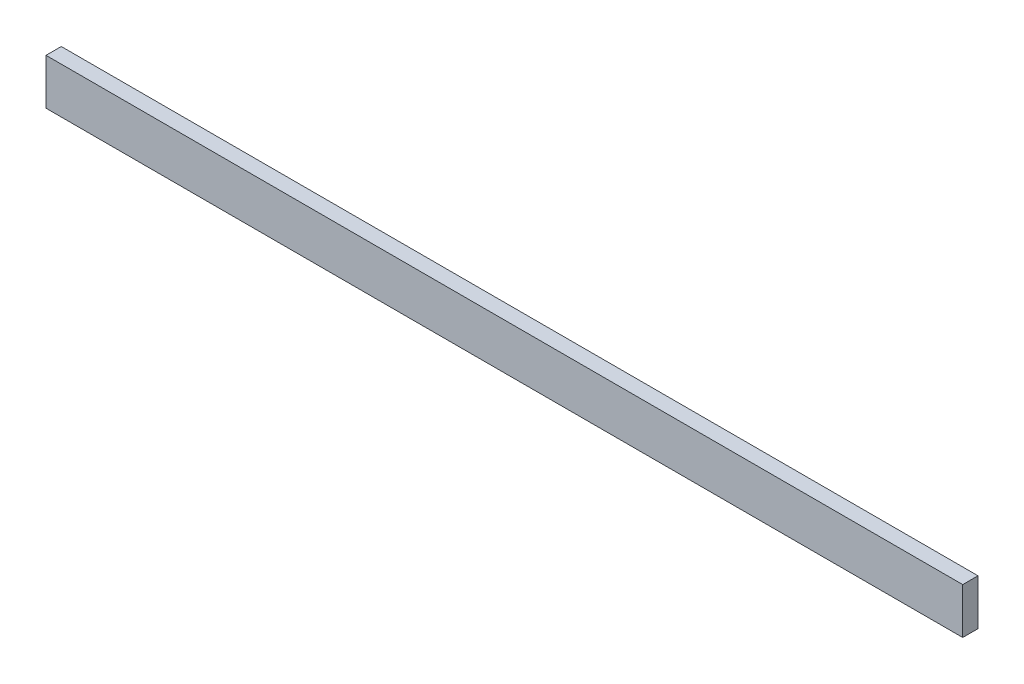
ISO-10303-21;
HEADER;
FILE_DESCRIPTION(('STEP AP214'),'2;1');
FILE_NAME('part.step','',(''),(''),'','','');
FILE_SCHEMA(('AUTOMOTIVE_DESIGN { 1 0 10303 214 1 1 1 1 }'));
ENDSEC;
DATA;
#1=APPLICATION_CONTEXT('core data for automotive mechanical design processes');
#2=APPLICATION_PROTOCOL_DEFINITION('international standard','automotive_design',2000,#1);
#3=PRODUCT_CONTEXT('',#1,'mechanical');
#4=PRODUCT('Part','Part','',(#3));
#5=PRODUCT_RELATED_PRODUCT_CATEGORY('part','',(#4));
#6=PRODUCT_DEFINITION_FORMATION('','',#4);
#7=PRODUCT_DEFINITION_CONTEXT('part definition',#1,'design');
#8=PRODUCT_DEFINITION('design','',#6,#7);
#9=PRODUCT_DEFINITION_SHAPE('','',#8);
#10=(LENGTH_UNIT() NAMED_UNIT(*) SI_UNIT(.MILLI.,.METRE.));
#11=(NAMED_UNIT(*) PLANE_ANGLE_UNIT() SI_UNIT($,.RADIAN.));
#12=(NAMED_UNIT(*) SI_UNIT($,.STERADIAN.) SOLID_ANGLE_UNIT());
#13=UNCERTAINTY_MEASURE_WITH_UNIT(LENGTH_MEASURE(1.E-05),#10,'distance_accuracy_value','');
#14=(GEOMETRIC_REPRESENTATION_CONTEXT(3) GLOBAL_UNCERTAINTY_ASSIGNED_CONTEXT((#13)) GLOBAL_UNIT_ASSIGNED_CONTEXT((#10,
#11,#12)) REPRESENTATION_CONTEXT('',''));
#15=CARTESIAN_POINT('',(0.,0.,0.));
#16=DIRECTION('',(0.,0.,1.));
#17=DIRECTION('',(1.,0.,0.));
#18=AXIS2_PLACEMENT_3D('',#15,#16,#17);
#19=CARTESIAN_POINT('',(-66.6093391855159,62.9999534455289,12.7));
#20=DIRECTION('',(1.,0.,0.));
#21=DIRECTION('',(0.,0.,-1.));
#22=AXIS2_PLACEMENT_3D('',#19,#20,#21);
#23=PLANE('',#22);
#24=DIRECTION('',(0.,-1.,0.));
#25=VECTOR('',#24,1.);
#26=CARTESIAN_POINT('',(-66.6093391855159,62.9999534455289,0.));
#27=LINE('',#26,#25);
#28=CARTESIAN_POINT('',(-66.6093391855159,62.9999534455289,0.));
#29=VERTEX_POINT('',#28);
#30=CARTESIAN_POINT('',(-66.6093391855159,24.899953445529,0.));
#31=VERTEX_POINT('',#30);
#32=EDGE_CURVE('E94',#29,#31,#27,.T.);
#33=ORIENTED_EDGE('',*,*,#32,.T.);
#34=DIRECTION('',(0.,0.,-1.));
#35=VECTOR('',#34,1.);
#36=CARTESIAN_POINT('',(-66.6093391855159,24.899953445529,12.7));
#37=LINE('',#36,#35);
#38=CARTESIAN_POINT('',(-66.6093391855159,24.899953445529,12.7));
#39=VERTEX_POINT('',#38);
#40=EDGE_CURVE('E11',#39,#31,#37,.T.);
#41=ORIENTED_EDGE('',*,*,#40,.F.);
#42=DIRECTION('',(0.,-1.,0.));
#43=VECTOR('',#42,1.);
#44=CARTESIAN_POINT('',(-66.6093391855159,62.9999534455289,12.7));
#45=LINE('',#44,#43);
#46=CARTESIAN_POINT('',(-66.6093391855159,62.9999534455289,12.7));
#47=VERTEX_POINT('',#46);
#48=EDGE_CURVE('E82',#47,#39,#45,.T.);
#49=ORIENTED_EDGE('',*,*,#48,.F.);
#50=DIRECTION('',(0.,0.,-1.));
#51=VECTOR('',#50,1.);
#52=CARTESIAN_POINT('',(-66.6093391855159,62.9999534455289,12.7));
#53=LINE('',#52,#51);
#54=EDGE_CURVE('E90',#47,#29,#53,.T.);
#55=ORIENTED_EDGE('',*,*,#54,.T.);
#56=EDGE_LOOP('',(#33,#41,#49,#55));
#57=FACE_BOUND('',#56,.T.);
#58=ADVANCED_FACE('F31',(#57),#23,.F.);
#59=CARTESIAN_POINT('',(-66.6093391855159,24.899953445529,12.7));
#60=DIRECTION('',(0.,1.,0.));
#61=DIRECTION('',(0.,0.,1.));
#62=AXIS2_PLACEMENT_3D('',#59,#60,#61);
#63=PLANE('',#62);
#64=DIRECTION('',(1.,0.,0.));
#65=VECTOR('',#64,1.);
#66=CARTESIAN_POINT('',(-66.6093391855159,24.899953445529,0.));
#67=LINE('',#66,#65);
#68=CARTESIAN_POINT('',(695.390660814484,24.899953445529,0.));
#69=VERTEX_POINT('',#68);
#70=EDGE_CURVE('E86',#31,#69,#67,.T.);
#71=ORIENTED_EDGE('',*,*,#70,.T.);
#72=DIRECTION('',(0.,0.,-1.));
#73=VECTOR('',#72,1.);
#74=CARTESIAN_POINT('',(695.390660814484,24.899953445529,12.7));
#75=LINE('',#74,#73);
#76=CARTESIAN_POINT('',(695.390660814484,24.899953445529,12.7));
#77=VERTEX_POINT('',#76);
#78=EDGE_CURVE('E39',#77,#69,#75,.T.);
#79=ORIENTED_EDGE('',*,*,#78,.F.);
#80=DIRECTION('',(1.,0.,0.));
#81=VECTOR('',#80,1.);
#82=CARTESIAN_POINT('',(-66.6093391855159,24.899953445529,12.7));
#83=LINE('',#82,#81);
#84=EDGE_CURVE('E77',#39,#77,#83,.T.);
#85=ORIENTED_EDGE('',*,*,#84,.F.);
#86=ORIENTED_EDGE('',*,*,#40,.T.);
#87=EDGE_LOOP('',(#71,#79,#85,#86));
#88=FACE_BOUND('',#87,.T.);
#89=ADVANCED_FACE('F85',(#88),#63,.F.);
#90=CARTESIAN_POINT('',(695.390660814484,62.9999534455289,12.7));
#91=DIRECTION('',(-1.,0.,0.));
#92=DIRECTION('',(0.,0.,1.));
#93=AXIS2_PLACEMENT_3D('',#90,#91,#92);
#94=PLANE('',#93);
#95=DIRECTION('',(0.,1.,0.));
#96=VECTOR('',#95,1.);
#97=CARTESIAN_POINT('',(695.390660814484,62.9999534455289,0.));
#98=LINE('',#97,#96);
#99=CARTESIAN_POINT('',(695.390660814484,62.9999534455289,0.));
#100=VERTEX_POINT('',#99);
#101=EDGE_CURVE('E64',#69,#100,#98,.T.);
#102=ORIENTED_EDGE('',*,*,#101,.T.);
#103=DIRECTION('',(0.,0.,-1.));
#104=VECTOR('',#103,1.);
#105=CARTESIAN_POINT('',(695.390660814484,62.9999534455289,12.7));
#106=LINE('',#105,#104);
#107=CARTESIAN_POINT('',(695.390660814484,62.9999534455289,12.7));
#108=VERTEX_POINT('',#107);
#109=EDGE_CURVE('E87',#108,#100,#106,.T.);
#110=ORIENTED_EDGE('',*,*,#109,.F.);
#111=DIRECTION('',(0.,1.,0.));
#112=VECTOR('',#111,1.);
#113=CARTESIAN_POINT('',(695.390660814484,62.9999534455289,12.7));
#114=LINE('',#113,#112);
#115=EDGE_CURVE('E80',#77,#108,#114,.T.);
#116=ORIENTED_EDGE('',*,*,#115,.F.);
#117=ORIENTED_EDGE('',*,*,#78,.T.);
#118=EDGE_LOOP('',(#102,#110,#116,#117));
#119=FACE_BOUND('',#118,.T.);
#120=ADVANCED_FACE('F88',(#119),#94,.F.);
#121=CARTESIAN_POINT('',(-66.6093391855159,62.9999534455289,12.7));
#122=DIRECTION('',(0.,-1.,0.));
#123=DIRECTION('',(0.,0.,-1.));
#124=AXIS2_PLACEMENT_3D('',#121,#122,#123);
#125=PLANE('',#124);
#126=DIRECTION('',(-1.,0.,0.));
#127=VECTOR('',#126,1.);
#128=CARTESIAN_POINT('',(-66.6093391855159,62.9999534455289,0.));
#129=LINE('',#128,#127);
#130=EDGE_CURVE('E70',#100,#29,#129,.T.);
#131=ORIENTED_EDGE('',*,*,#130,.T.);
#132=ORIENTED_EDGE('',*,*,#54,.F.);
#133=DIRECTION('',(-1.,0.,0.));
#134=VECTOR('',#133,1.);
#135=CARTESIAN_POINT('',(-66.6093391855159,62.9999534455289,12.7));
#136=LINE('',#135,#134);
#137=EDGE_CURVE('E47',#108,#47,#136,.T.);
#138=ORIENTED_EDGE('',*,*,#137,.F.);
#139=ORIENTED_EDGE('',*,*,#109,.T.);
#140=EDGE_LOOP('',(#131,#132,#138,#139));
#141=FACE_BOUND('',#140,.T.);
#142=ADVANCED_FACE('F101',(#141),#125,.F.);
#143=CARTESIAN_POINT('',(-66.6093391855159,24.899953445529,12.7));
#144=DIRECTION('',(0.,0.,1.));
#145=DIRECTION('',(1.,0.,0.));
#146=AXIS2_PLACEMENT_3D('',#143,#144,#145);
#147=PLANE('',#146);
#148=ORIENTED_EDGE('',*,*,#48,.T.);
#149=ORIENTED_EDGE('',*,*,#84,.T.);
#150=ORIENTED_EDGE('',*,*,#115,.T.);
#151=ORIENTED_EDGE('',*,*,#137,.T.);
#152=EDGE_LOOP('',(#148,#149,#150,#151));
#153=FACE_BOUND('',#152,.T.);
#154=ADVANCED_FACE('F78',(#153),#147,.T.);
#155=CARTESIAN_POINT('',(-66.6093391855159,24.899953445529,0.));
#156=DIRECTION('',(0.,0.,1.));
#157=DIRECTION('',(1.,0.,0.));
#158=AXIS2_PLACEMENT_3D('',#155,#156,#157);
#159=PLANE('',#158);
#160=ORIENTED_EDGE('',*,*,#32,.F.);
#161=ORIENTED_EDGE('',*,*,#130,.F.);
#162=ORIENTED_EDGE('',*,*,#101,.F.);
#163=ORIENTED_EDGE('',*,*,#70,.F.);
#164=EDGE_LOOP('',(#160,#161,#162,#163));
#165=FACE_BOUND('',#164,.T.);
#166=ADVANCED_FACE('F104',(#165),#159,.F.);
#167=CLOSED_SHELL('',(#58,#89,#120,#142,#154,#166));
#168=MANIFOLD_SOLID_BREP('B2',#167);
#169=ADVANCED_BREP_SHAPE_REPRESENTATION('',(#18,#168),#14);
#170=SHAPE_DEFINITION_REPRESENTATION(#9,#169);
ENDSEC;
END-ISO-10303-21;
